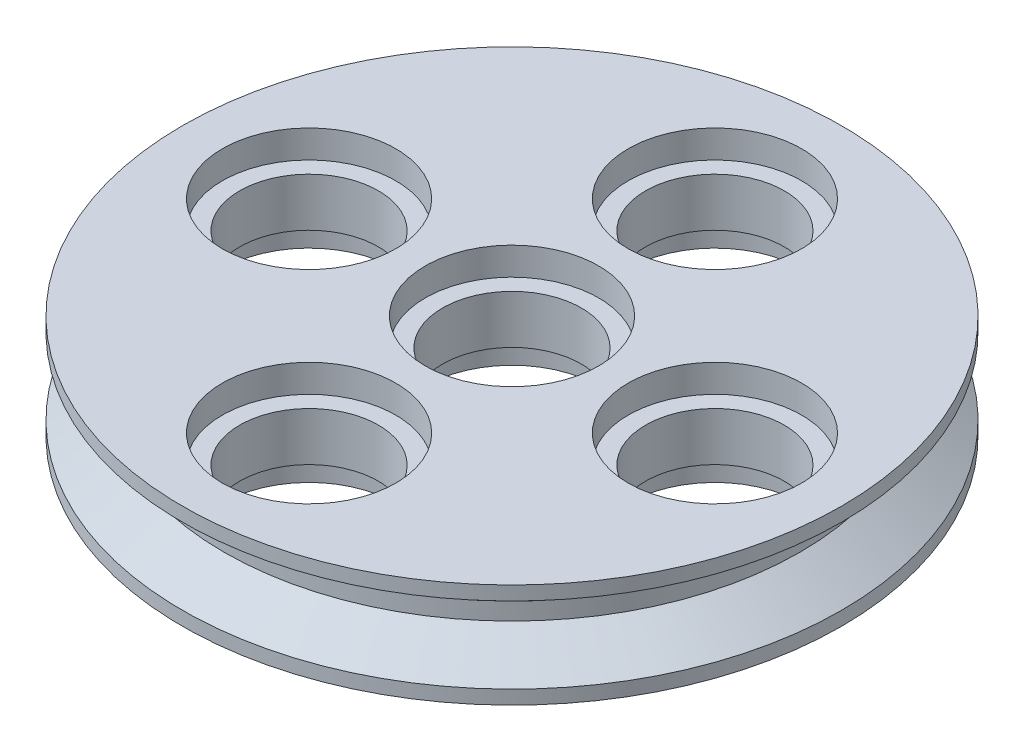
ISO-10303-21;
HEADER;
FILE_DESCRIPTION(('STEP AP214'),'2;1');
FILE_NAME('part.step','',(''),(''),'','','');
FILE_SCHEMA(('AUTOMOTIVE_DESIGN { 1 0 10303 214 1 1 1 1 }'));
ENDSEC;
DATA;
#1=APPLICATION_CONTEXT('core data for automotive mechanical design processes');
#2=APPLICATION_PROTOCOL_DEFINITION('international standard','automotive_design',2000,#1);
#3=PRODUCT_CONTEXT('',#1,'mechanical');
#4=PRODUCT('Part','Part','',(#3));
#5=PRODUCT_RELATED_PRODUCT_CATEGORY('part','',(#4));
#6=PRODUCT_DEFINITION_FORMATION('','',#4);
#7=PRODUCT_DEFINITION_CONTEXT('part definition',#1,'design');
#8=PRODUCT_DEFINITION('design','',#6,#7);
#9=PRODUCT_DEFINITION_SHAPE('','',#8);
#10=(LENGTH_UNIT() NAMED_UNIT(*) SI_UNIT(.MILLI.,.METRE.));
#11=(NAMED_UNIT(*) PLANE_ANGLE_UNIT() SI_UNIT($,.RADIAN.));
#12=(NAMED_UNIT(*) SI_UNIT($,.STERADIAN.) SOLID_ANGLE_UNIT());
#13=UNCERTAINTY_MEASURE_WITH_UNIT(LENGTH_MEASURE(1.E-05),#10,'distance_accuracy_value','');
#14=(GEOMETRIC_REPRESENTATION_CONTEXT(3) GLOBAL_UNCERTAINTY_ASSIGNED_CONTEXT((#13)) GLOBAL_UNIT_ASSIGNED_CONTEXT((#10,
#11,#12)) REPRESENTATION_CONTEXT('',''));
#15=CARTESIAN_POINT('',(0.,0.,0.));
#16=DIRECTION('',(0.,0.,1.));
#17=DIRECTION('',(1.,0.,0.));
#18=AXIS2_PLACEMENT_3D('',#15,#16,#17);
#19=CARTESIAN_POINT('',(0.,0.75,0.));
#20=DIRECTION('',(0.,1.,0.));
#21=DIRECTION('',(-1.,0.,0.));
#22=AXIS2_PLACEMENT_3D('',#19,#20,#21);
#23=CYLINDRICAL_SURFACE('',#22,8.3006668519548);
#24=CARTESIAN_POINT('',(0.,-0.500000000000001,0.));
#25=DIRECTION('',(0.,1.,0.));
#26=DIRECTION('',(-1.,0.,0.));
#27=AXIS2_PLACEMENT_3D('',#24,#25,#26);
#28=CIRCLE('',#27,8.3006668519548);
#29=CARTESIAN_POINT('',(-8.3006668519548,-0.500000000000003,0.));
#30=VERTEX_POINT('',#29);
#31=EDGE_CURVE('E10',#30,#30,#28,.T.);
#32=ORIENTED_EDGE('',*,*,#31,.F.);
#33=EDGE_LOOP('',(#32));
#34=FACE_BOUND('',#33,.T.);
#35=CARTESIAN_POINT('',(0.,-1.,0.));
#36=DIRECTION('',(0.,1.,0.));
#37=DIRECTION('',(-1.,0.,0.));
#38=AXIS2_PLACEMENT_3D('',#35,#36,#37);
#39=CIRCLE('',#38,8.3006668519548);
#40=CARTESIAN_POINT('',(-8.3006668519548,-1.,0.));
#41=VERTEX_POINT('',#40);
#42=EDGE_CURVE('E91',#41,#41,#39,.T.);
#43=ORIENTED_EDGE('',*,*,#42,.T.);
#44=EDGE_LOOP('',(#43));
#45=FACE_BOUND('',#44,.T.);
#46=ADVANCED_FACE('F30',(#34,#45),#23,.T.);
#47=CARTESIAN_POINT('',(0.,-0.500000000000001,0.));
#48=DIRECTION('',(0.,1.,0.));
#49=DIRECTION('',(-1.,0.,0.));
#50=AXIS2_PLACEMENT_3D('',#47,#48,#49);
#51=CONICAL_SURFACE('',#50,8.3006668519548,0.954237177155271);
#52=CARTESIAN_POINT('',(0.,0.349999999999997,0.));
#53=DIRECTION('',(0.,1.,0.));
#54=DIRECTION('',(-1.,0.,0.));
#55=AXIS2_PLACEMENT_3D('',#52,#53,#54);
#56=CIRCLE('',#55,9.5);
#57=CARTESIAN_POINT('',(-9.5,0.349999999999994,0.));
#58=VERTEX_POINT('',#57);
#59=EDGE_CURVE('E36',#58,#58,#56,.T.);
#60=ORIENTED_EDGE('',*,*,#59,.F.);
#61=EDGE_LOOP('',(#60));
#62=FACE_BOUND('',#61,.T.);
#63=ORIENTED_EDGE('',*,*,#31,.T.);
#64=EDGE_LOOP('',(#63));
#65=FACE_BOUND('',#64,.T.);
#66=ADVANCED_FACE('F161',(#62,#65),#51,.T.);
#67=CARTESIAN_POINT('',(0.,0.75,0.));
#68=DIRECTION('',(0.,1.,0.));
#69=DIRECTION('',(-1.,0.,0.));
#70=AXIS2_PLACEMENT_3D('',#67,#68,#69);
#71=CYLINDRICAL_SURFACE('',#70,9.5);
#72=CARTESIAN_POINT('',(0.,0.749999999999997,0.));
#73=DIRECTION('',(0.,1.,0.));
#74=DIRECTION('',(-1.,0.,0.));
#75=AXIS2_PLACEMENT_3D('',#72,#73,#74);
#76=CIRCLE('',#75,9.5);
#77=CARTESIAN_POINT('',(-9.5,0.749999999999994,0.));
#78=VERTEX_POINT('',#77);
#79=EDGE_CURVE('E40',#78,#78,#76,.T.);
#80=ORIENTED_EDGE('',*,*,#79,.F.);
#81=EDGE_LOOP('',(#80));
#82=FACE_BOUND('',#81,.T.);
#83=ORIENTED_EDGE('',*,*,#59,.T.);
#84=EDGE_LOOP('',(#83));
#85=FACE_BOUND('',#84,.T.);
#86=ADVANCED_FACE('F166',(#82,#85),#71,.T.);
#87=CARTESIAN_POINT('',(0.,0.749999999999998,0.));
#88=DIRECTION('',(0.,-1.,0.));
#89=DIRECTION('',(1.,0.,0.));
#90=AXIS2_PLACEMENT_3D('',#87,#88,#89);
#91=PLANE('',#90);
#92=CARTESIAN_POINT('',(0.,0.750000000000002,0.));
#93=DIRECTION('',(0.,1.,0.));
#94=DIRECTION('',(0.,0.,1.));
#95=AXIS2_PLACEMENT_3D('',#92,#93,#94);
#96=CIRCLE('',#95,2.5);
#97=CARTESIAN_POINT('',(0.,0.750000000000002,2.5));
#98=VERTEX_POINT('',#97);
#99=EDGE_CURVE('E88',#98,#98,#96,.T.);
#100=ORIENTED_EDGE('',*,*,#99,.F.);
#101=EDGE_LOOP('',(#100));
#102=FACE_BOUND('',#101,.T.);
#103=CARTESIAN_POINT('',(-5.85,0.75,0.));
#104=DIRECTION('',(0.,1.,0.));
#105=DIRECTION('',(0.,0.,1.));
#106=AXIS2_PLACEMENT_3D('',#103,#104,#105);
#107=CIRCLE('',#106,2.5);
#108=CARTESIAN_POINT('',(-5.85,0.75,2.5));
#109=VERTEX_POINT('',#108);
#110=EDGE_CURVE('E79',#109,#109,#107,.T.);
#111=ORIENTED_EDGE('',*,*,#110,.F.);
#112=EDGE_LOOP('',(#111));
#113=FACE_BOUND('',#112,.T.);
#114=CARTESIAN_POINT('',(5.85,0.750000000000004,0.));
#115=DIRECTION('',(0.,1.,0.));
#116=DIRECTION('',(0.,0.,1.));
#117=AXIS2_PLACEMENT_3D('',#114,#115,#116);
#118=CIRCLE('',#117,2.5);
#119=CARTESIAN_POINT('',(5.85,0.750000000000004,2.5));
#120=VERTEX_POINT('',#119);
#121=EDGE_CURVE('E70',#120,#120,#118,.T.);
#122=ORIENTED_EDGE('',*,*,#121,.F.);
#123=EDGE_LOOP('',(#122));
#124=FACE_BOUND('',#123,.T.);
#125=CARTESIAN_POINT('',(0.,0.750000000000002,-5.85));
#126=DIRECTION('',(0.,1.,0.));
#127=DIRECTION('',(0.,0.,1.));
#128=AXIS2_PLACEMENT_3D('',#125,#126,#127);
#129=CIRCLE('',#128,2.5);
#130=CARTESIAN_POINT('',(0.,0.750000000000002,-3.35));
#131=VERTEX_POINT('',#130);
#132=EDGE_CURVE('E61',#131,#131,#129,.T.);
#133=ORIENTED_EDGE('',*,*,#132,.F.);
#134=EDGE_LOOP('',(#133));
#135=FACE_BOUND('',#134,.T.);
#136=CARTESIAN_POINT('',(0.,0.750000000000002,5.85));
#137=DIRECTION('',(0.,1.,0.));
#138=DIRECTION('',(0.,0.,1.));
#139=AXIS2_PLACEMENT_3D('',#136,#137,#138);
#140=CIRCLE('',#139,2.5);
#141=CARTESIAN_POINT('',(0.,0.750000000000002,8.35));
#142=VERTEX_POINT('',#141);
#143=EDGE_CURVE('E52',#142,#142,#140,.T.);
#144=ORIENTED_EDGE('',*,*,#143,.F.);
#145=EDGE_LOOP('',(#144));
#146=FACE_BOUND('',#145,.T.);
#147=ORIENTED_EDGE('',*,*,#79,.T.);
#148=EDGE_LOOP('',(#147));
#149=FACE_BOUND('',#148,.T.);
#150=ADVANCED_FACE('F242',(#102,#113,#124,#135,#146,#149),#91,.F.);
#151=CARTESIAN_POINT('',(0.,0.749999999999998,5.85));
#152=DIRECTION('',(0.,1.,0.));
#153=DIRECTION('',(0.,0.,1.));
#154=AXIS2_PLACEMENT_3D('',#151,#152,#153);
#155=CYLINDRICAL_SURFACE('',#154,2.00000000000001);
#156=CARTESIAN_POINT('',(0.,-0.0499999999999968,5.85));
#157=DIRECTION('',(0.,1.,0.));
#158=DIRECTION('',(0.,0.,1.));
#159=AXIS2_PLACEMENT_3D('',#156,#157,#158);
#160=CIRCLE('',#159,2.00000000000001);
#161=CARTESIAN_POINT('',(0.,-0.0499999999999968,7.85000000000001));
#162=VERTEX_POINT('',#161);
#163=EDGE_CURVE('E44',#162,#162,#160,.T.);
#164=ORIENTED_EDGE('',*,*,#163,.T.);
#165=EDGE_LOOP('',(#164));
#166=FACE_BOUND('',#165,.T.);
#167=CARTESIAN_POINT('',(0.,-1.45000000000001,5.85));
#168=DIRECTION('',(0.,1.,0.));
#169=DIRECTION('',(0.,0.,1.));
#170=AXIS2_PLACEMENT_3D('',#167,#168,#169);
#171=CIRCLE('',#170,2.00000000000001);
#172=CARTESIAN_POINT('',(0.,-1.45000000000001,7.85000000000001));
#173=VERTEX_POINT('',#172);
#174=EDGE_CURVE('E100',#173,#173,#171,.T.);
#175=ORIENTED_EDGE('',*,*,#174,.F.);
#176=EDGE_LOOP('',(#175));
#177=FACE_BOUND('',#176,.T.);
#178=ADVANCED_FACE('F238',(#166,#177),#155,.F.);
#179=CARTESIAN_POINT('',(2.00000000000001,-0.0499999999999985,5.85));
#180=DIRECTION('',(0.,-1.,0.));
#181=DIRECTION('',(0.,0.,-1.));
#182=AXIS2_PLACEMENT_3D('',#179,#180,#181);
#183=PLANE('',#182);
#184=ORIENTED_EDGE('',*,*,#163,.F.);
#185=EDGE_LOOP('',(#184));
#186=FACE_BOUND('',#185,.T.);
#187=CARTESIAN_POINT('',(0.,-0.0500000000000002,5.85));
#188=DIRECTION('',(0.,1.,0.));
#189=DIRECTION('',(0.,0.,1.));
#190=AXIS2_PLACEMENT_3D('',#187,#188,#189);
#191=CIRCLE('',#190,2.5);
#192=CARTESIAN_POINT('',(0.,-0.0500000000000002,8.35));
#193=VERTEX_POINT('',#192);
#194=EDGE_CURVE('E49',#193,#193,#191,.T.);
#195=ORIENTED_EDGE('',*,*,#194,.T.);
#196=EDGE_LOOP('',(#195));
#197=FACE_BOUND('',#196,.T.);
#198=ADVANCED_FACE('F234',(#186,#197),#183,.F.);
#199=CARTESIAN_POINT('',(0.,0.749999999999998,5.85));
#200=DIRECTION('',(0.,1.,0.));
#201=DIRECTION('',(0.,0.,1.));
#202=AXIS2_PLACEMENT_3D('',#199,#200,#201);
#203=CYLINDRICAL_SURFACE('',#202,2.5);
#204=ORIENTED_EDGE('',*,*,#194,.F.);
#205=EDGE_LOOP('',(#204));
#206=FACE_BOUND('',#205,.T.);
#207=ORIENTED_EDGE('',*,*,#143,.T.);
#208=EDGE_LOOP('',(#207));
#209=FACE_BOUND('',#208,.T.);
#210=ADVANCED_FACE('F230',(#206,#209),#203,.F.);
#211=CARTESIAN_POINT('',(0.,0.749999999999998,-5.85));
#212=DIRECTION('',(0.,1.,0.));
#213=DIRECTION('',(0.,0.,1.));
#214=AXIS2_PLACEMENT_3D('',#211,#212,#213);
#215=CYLINDRICAL_SURFACE('',#214,2.00000000000001);
#216=CARTESIAN_POINT('',(0.,-0.0499999999999968,-5.85));
#217=DIRECTION('',(0.,1.,0.));
#218=DIRECTION('',(0.,0.,1.));
#219=AXIS2_PLACEMENT_3D('',#216,#217,#218);
#220=CIRCLE('',#219,2.00000000000001);
#221=CARTESIAN_POINT('',(0.,-0.0499999999999968,-3.84999999999999));
#222=VERTEX_POINT('',#221);
#223=EDGE_CURVE('E55',#222,#222,#220,.T.);
#224=ORIENTED_EDGE('',*,*,#223,.T.);
#225=EDGE_LOOP('',(#224));
#226=FACE_BOUND('',#225,.T.);
#227=CARTESIAN_POINT('',(0.,-1.45000000000001,-5.85));
#228=DIRECTION('',(0.,1.,0.));
#229=DIRECTION('',(0.,0.,1.));
#230=AXIS2_PLACEMENT_3D('',#227,#228,#229);
#231=CIRCLE('',#230,2.00000000000001);
#232=CARTESIAN_POINT('',(0.,-1.45000000000001,-3.84999999999999));
#233=VERTEX_POINT('',#232);
#234=EDGE_CURVE('E109',#233,#233,#231,.T.);
#235=ORIENTED_EDGE('',*,*,#234,.F.);
#236=EDGE_LOOP('',(#235));
#237=FACE_BOUND('',#236,.T.);
#238=ADVANCED_FACE('F226',(#226,#237),#215,.F.);
#239=CARTESIAN_POINT('',(2.00000000000001,-0.0499999999999985,-5.85));
#240=DIRECTION('',(0.,-1.,0.));
#241=DIRECTION('',(0.,0.,-1.));
#242=AXIS2_PLACEMENT_3D('',#239,#240,#241);
#243=PLANE('',#242);
#244=ORIENTED_EDGE('',*,*,#223,.F.);
#245=EDGE_LOOP('',(#244));
#246=FACE_BOUND('',#245,.T.);
#247=CARTESIAN_POINT('',(0.,-0.0500000000000002,-5.85));
#248=DIRECTION('',(0.,1.,0.));
#249=DIRECTION('',(0.,0.,1.));
#250=AXIS2_PLACEMENT_3D('',#247,#248,#249);
#251=CIRCLE('',#250,2.5);
#252=CARTESIAN_POINT('',(0.,-0.0500000000000002,-3.35));
#253=VERTEX_POINT('',#252);
#254=EDGE_CURVE('E58',#253,#253,#251,.T.);
#255=ORIENTED_EDGE('',*,*,#254,.T.);
#256=EDGE_LOOP('',(#255));
#257=FACE_BOUND('',#256,.T.);
#258=ADVANCED_FACE('F222',(#246,#257),#243,.F.);
#259=CARTESIAN_POINT('',(0.,0.749999999999998,-5.85));
#260=DIRECTION('',(0.,1.,0.));
#261=DIRECTION('',(0.,0.,1.));
#262=AXIS2_PLACEMENT_3D('',#259,#260,#261);
#263=CYLINDRICAL_SURFACE('',#262,2.5);
#264=ORIENTED_EDGE('',*,*,#254,.F.);
#265=EDGE_LOOP('',(#264));
#266=FACE_BOUND('',#265,.T.);
#267=ORIENTED_EDGE('',*,*,#132,.T.);
#268=EDGE_LOOP('',(#267));
#269=FACE_BOUND('',#268,.T.);
#270=ADVANCED_FACE('F218',(#266,#269),#263,.F.);
#271=CARTESIAN_POINT('',(5.85,0.75,0.));
#272=DIRECTION('',(0.,1.,0.));
#273=DIRECTION('',(0.,0.,1.));
#274=AXIS2_PLACEMENT_3D('',#271,#272,#273);
#275=CYLINDRICAL_SURFACE('',#274,2.00000000000001);
#276=CARTESIAN_POINT('',(5.85,-0.0499999999999949,0.));
#277=DIRECTION('',(0.,1.,0.));
#278=DIRECTION('',(0.,0.,1.));
#279=AXIS2_PLACEMENT_3D('',#276,#277,#278);
#280=CIRCLE('',#279,2.00000000000001);
#281=CARTESIAN_POINT('',(5.85,-0.0499999999999949,2.00000000000001));
#282=VERTEX_POINT('',#281);
#283=EDGE_CURVE('E64',#282,#282,#280,.T.);
#284=ORIENTED_EDGE('',*,*,#283,.T.);
#285=EDGE_LOOP('',(#284));
#286=FACE_BOUND('',#285,.T.);
#287=CARTESIAN_POINT('',(5.85,-1.45,0.));
#288=DIRECTION('',(0.,1.,0.));
#289=DIRECTION('',(0.,0.,1.));
#290=AXIS2_PLACEMENT_3D('',#287,#288,#289);
#291=CIRCLE('',#290,2.00000000000001);
#292=CARTESIAN_POINT('',(5.85,-1.45,2.00000000000001));
#293=VERTEX_POINT('',#292);
#294=EDGE_CURVE('E118',#293,#293,#291,.T.);
#295=ORIENTED_EDGE('',*,*,#294,.F.);
#296=EDGE_LOOP('',(#295));
#297=FACE_BOUND('',#296,.T.);
#298=ADVANCED_FACE('F214',(#286,#297),#275,.F.);
#299=CARTESIAN_POINT('',(7.85000000000001,-0.0499999999999967,0.));
#300=DIRECTION('',(0.,-1.,0.));
#301=DIRECTION('',(0.,0.,-1.));
#302=AXIS2_PLACEMENT_3D('',#299,#300,#301);
#303=PLANE('',#302);
#304=ORIENTED_EDGE('',*,*,#283,.F.);
#305=EDGE_LOOP('',(#304));
#306=FACE_BOUND('',#305,.T.);
#307=CARTESIAN_POINT('',(5.85,-0.0499999999999984,0.));
#308=DIRECTION('',(0.,1.,0.));
#309=DIRECTION('',(0.,0.,1.));
#310=AXIS2_PLACEMENT_3D('',#307,#308,#309);
#311=CIRCLE('',#310,2.5);
#312=CARTESIAN_POINT('',(5.85,-0.0499999999999984,2.5));
#313=VERTEX_POINT('',#312);
#314=EDGE_CURVE('E67',#313,#313,#311,.T.);
#315=ORIENTED_EDGE('',*,*,#314,.T.);
#316=EDGE_LOOP('',(#315));
#317=FACE_BOUND('',#316,.T.);
#318=ADVANCED_FACE('F210',(#306,#317),#303,.F.);
#319=CARTESIAN_POINT('',(5.85,0.75,0.));
#320=DIRECTION('',(0.,1.,0.));
#321=DIRECTION('',(0.,0.,1.));
#322=AXIS2_PLACEMENT_3D('',#319,#320,#321);
#323=CYLINDRICAL_SURFACE('',#322,2.5);
#324=ORIENTED_EDGE('',*,*,#314,.F.);
#325=EDGE_LOOP('',(#324));
#326=FACE_BOUND('',#325,.T.);
#327=ORIENTED_EDGE('',*,*,#121,.T.);
#328=EDGE_LOOP('',(#327));
#329=FACE_BOUND('',#328,.T.);
#330=ADVANCED_FACE('F206',(#326,#329),#323,.F.);
#331=CARTESIAN_POINT('',(-5.85,0.749999999999997,0.));
#332=DIRECTION('',(0.,1.,0.));
#333=DIRECTION('',(0.,0.,1.));
#334=AXIS2_PLACEMENT_3D('',#331,#332,#333);
#335=CYLINDRICAL_SURFACE('',#334,2.00000000000001);
#336=CARTESIAN_POINT('',(-5.85,-0.0499999999999986,0.));
#337=DIRECTION('',(0.,1.,0.));
#338=DIRECTION('',(0.,0.,1.));
#339=AXIS2_PLACEMENT_3D('',#336,#337,#338);
#340=CIRCLE('',#339,2.00000000000001);
#341=CARTESIAN_POINT('',(-5.85,-0.0499999999999986,2.00000000000001));
#342=VERTEX_POINT('',#341);
#343=EDGE_CURVE('E73',#342,#342,#340,.T.);
#344=ORIENTED_EDGE('',*,*,#343,.T.);
#345=EDGE_LOOP('',(#344));
#346=FACE_BOUND('',#345,.T.);
#347=CARTESIAN_POINT('',(-5.85,-1.45000000000001,0.));
#348=DIRECTION('',(0.,1.,0.));
#349=DIRECTION('',(0.,0.,1.));
#350=AXIS2_PLACEMENT_3D('',#347,#348,#349);
#351=CIRCLE('',#350,2.00000000000001);
#352=CARTESIAN_POINT('',(-5.85,-1.45000000000001,2.00000000000001));
#353=VERTEX_POINT('',#352);
#354=EDGE_CURVE('E127',#353,#353,#351,.T.);
#355=ORIENTED_EDGE('',*,*,#354,.F.);
#356=EDGE_LOOP('',(#355));
#357=FACE_BOUND('',#356,.T.);
#358=ADVANCED_FACE('F202',(#346,#357),#335,.F.);
#359=CARTESIAN_POINT('',(-3.84999999999999,-0.0500000000000003,0.));
#360=DIRECTION('',(0.,-1.,0.));
#361=DIRECTION('',(0.,0.,-1.));
#362=AXIS2_PLACEMENT_3D('',#359,#360,#361);
#363=PLANE('',#362);
#364=ORIENTED_EDGE('',*,*,#343,.F.);
#365=EDGE_LOOP('',(#364));
#366=FACE_BOUND('',#365,.T.);
#367=CARTESIAN_POINT('',(-5.85,-0.0500000000000021,0.));
#368=DIRECTION('',(0.,1.,0.));
#369=DIRECTION('',(0.,0.,1.));
#370=AXIS2_PLACEMENT_3D('',#367,#368,#369);
#371=CIRCLE('',#370,2.5);
#372=CARTESIAN_POINT('',(-5.85,-0.0500000000000021,2.5));
#373=VERTEX_POINT('',#372);
#374=EDGE_CURVE('E76',#373,#373,#371,.T.);
#375=ORIENTED_EDGE('',*,*,#374,.T.);
#376=EDGE_LOOP('',(#375));
#377=FACE_BOUND('',#376,.T.);
#378=ADVANCED_FACE('F198',(#366,#377),#363,.F.);
#379=CARTESIAN_POINT('',(-5.85,0.749999999999997,0.));
#380=DIRECTION('',(0.,1.,0.));
#381=DIRECTION('',(0.,0.,1.));
#382=AXIS2_PLACEMENT_3D('',#379,#380,#381);
#383=CYLINDRICAL_SURFACE('',#382,2.5);
#384=ORIENTED_EDGE('',*,*,#374,.F.);
#385=EDGE_LOOP('',(#384));
#386=FACE_BOUND('',#385,.T.);
#387=ORIENTED_EDGE('',*,*,#110,.T.);
#388=EDGE_LOOP('',(#387));
#389=FACE_BOUND('',#388,.T.);
#390=ADVANCED_FACE('F194',(#386,#389),#383,.F.);
#391=CARTESIAN_POINT('',(0.,0.749999999999998,0.));
#392=DIRECTION('',(0.,1.,0.));
#393=DIRECTION('',(0.,0.,1.));
#394=AXIS2_PLACEMENT_3D('',#391,#392,#393);
#395=CYLINDRICAL_SURFACE('',#394,2.00000000000001);
#396=CARTESIAN_POINT('',(0.,-0.0499999999999968,0.));
#397=DIRECTION('',(0.,1.,0.));
#398=DIRECTION('',(0.,0.,1.));
#399=AXIS2_PLACEMENT_3D('',#396,#397,#398);
#400=CIRCLE('',#399,2.00000000000001);
#401=CARTESIAN_POINT('',(0.,-0.0499999999999968,2.00000000000001));
#402=VERTEX_POINT('',#401);
#403=EDGE_CURVE('E82',#402,#402,#400,.T.);
#404=ORIENTED_EDGE('',*,*,#403,.T.);
#405=EDGE_LOOP('',(#404));
#406=FACE_BOUND('',#405,.T.);
#407=CARTESIAN_POINT('',(0.,-1.45000000000001,0.));
#408=DIRECTION('',(0.,1.,0.));
#409=DIRECTION('',(0.,0.,1.));
#410=AXIS2_PLACEMENT_3D('',#407,#408,#409);
#411=CIRCLE('',#410,2.00000000000001);
#412=CARTESIAN_POINT('',(0.,-1.45000000000001,2.00000000000001));
#413=VERTEX_POINT('',#412);
#414=EDGE_CURVE('E136',#413,#413,#411,.T.);
#415=ORIENTED_EDGE('',*,*,#414,.F.);
#416=EDGE_LOOP('',(#415));
#417=FACE_BOUND('',#416,.T.);
#418=ADVANCED_FACE('F190',(#406,#417),#395,.F.);
#419=CARTESIAN_POINT('',(2.00000000000001,-0.0499999999999985,0.));
#420=DIRECTION('',(0.,-1.,0.));
#421=DIRECTION('',(0.,0.,-1.));
#422=AXIS2_PLACEMENT_3D('',#419,#420,#421);
#423=PLANE('',#422);
#424=ORIENTED_EDGE('',*,*,#403,.F.);
#425=EDGE_LOOP('',(#424));
#426=FACE_BOUND('',#425,.T.);
#427=CARTESIAN_POINT('',(0.,-0.0500000000000002,0.));
#428=DIRECTION('',(0.,1.,0.));
#429=DIRECTION('',(0.,0.,1.));
#430=AXIS2_PLACEMENT_3D('',#427,#428,#429);
#431=CIRCLE('',#430,2.5);
#432=CARTESIAN_POINT('',(0.,-0.0500000000000002,2.5));
#433=VERTEX_POINT('',#432);
#434=EDGE_CURVE('E85',#433,#433,#431,.T.);
#435=ORIENTED_EDGE('',*,*,#434,.T.);
#436=EDGE_LOOP('',(#435));
#437=FACE_BOUND('',#436,.T.);
#438=ADVANCED_FACE('F183',(#426,#437),#423,.F.);
#439=CARTESIAN_POINT('',(0.,0.749999999999998,0.));
#440=DIRECTION('',(0.,1.,0.));
#441=DIRECTION('',(0.,0.,1.));
#442=AXIS2_PLACEMENT_3D('',#439,#440,#441);
#443=CYLINDRICAL_SURFACE('',#442,2.5);
#444=ORIENTED_EDGE('',*,*,#434,.F.);
#445=EDGE_LOOP('',(#444));
#446=FACE_BOUND('',#445,.T.);
#447=ORIENTED_EDGE('',*,*,#99,.T.);
#448=EDGE_LOOP('',(#447));
#449=FACE_BOUND('',#448,.T.);
#450=ADVANCED_FACE('F174',(#446,#449),#443,.F.);
#451=CARTESIAN_POINT('',(0.,-1.,0.));
#452=DIRECTION('',(0.,-1.,0.));
#453=DIRECTION('',(-1.,0.,0.));
#454=AXIS2_PLACEMENT_3D('',#451,#452,#453);
#455=CONICAL_SURFACE('',#454,8.3006668519548,0.954237177155271);
#456=CARTESIAN_POINT('',(0.,-1.85,0.));
#457=DIRECTION('',(0.,1.,0.));
#458=DIRECTION('',(-1.,0.,0.));
#459=AXIS2_PLACEMENT_3D('',#456,#457,#458);
#460=CIRCLE('',#459,9.5);
#461=CARTESIAN_POINT('',(-9.5,-1.85,0.));
#462=VERTEX_POINT('',#461);
#463=EDGE_CURVE('E94',#462,#462,#460,.T.);
#464=ORIENTED_EDGE('',*,*,#463,.T.);
#465=EDGE_LOOP('',(#464));
#466=FACE_BOUND('',#465,.T.);
#467=ORIENTED_EDGE('',*,*,#42,.F.);
#468=EDGE_LOOP('',(#467));
#469=FACE_BOUND('',#468,.T.);
#470=ADVANCED_FACE('F171',(#466,#469),#455,.T.);
#471=CARTESIAN_POINT('',(0.,-2.25,0.));
#472=DIRECTION('',(0.,-1.,0.));
#473=DIRECTION('',(-1.,0.,0.));
#474=AXIS2_PLACEMENT_3D('',#471,#472,#473);
#475=CYLINDRICAL_SURFACE('',#474,9.5);
#476=CARTESIAN_POINT('',(0.,-2.25,0.));
#477=DIRECTION('',(0.,1.,0.));
#478=DIRECTION('',(-1.,0.,0.));
#479=AXIS2_PLACEMENT_3D('',#476,#477,#478);
#480=CIRCLE('',#479,9.5);
#481=CARTESIAN_POINT('',(-9.5,-2.25,0.));
#482=VERTEX_POINT('',#481);
#483=EDGE_CURVE('E97',#482,#482,#480,.T.);
#484=ORIENTED_EDGE('',*,*,#483,.T.);
#485=EDGE_LOOP('',(#484));
#486=FACE_BOUND('',#485,.T.);
#487=ORIENTED_EDGE('',*,*,#463,.F.);
#488=EDGE_LOOP('',(#487));
#489=FACE_BOUND('',#488,.T.);
#490=ADVANCED_FACE('F173',(#486,#489),#475,.T.);
#491=CARTESIAN_POINT('',(0.,-2.25,0.));
#492=DIRECTION('',(0.,1.,0.));
#493=DIRECTION('',(1.,0.,0.));
#494=AXIS2_PLACEMENT_3D('',#491,#492,#493);
#495=PLANE('',#494);
#496=CARTESIAN_POINT('',(0.,-2.25,0.));
#497=DIRECTION('',(0.,1.,0.));
#498=DIRECTION('',(0.,0.,1.));
#499=AXIS2_PLACEMENT_3D('',#496,#497,#498);
#500=CIRCLE('',#499,2.5);
#501=CARTESIAN_POINT('',(0.,-2.25,2.5));
#502=VERTEX_POINT('',#501);
#503=EDGE_CURVE('E142',#502,#502,#500,.T.);
#504=ORIENTED_EDGE('',*,*,#503,.T.);
#505=EDGE_LOOP('',(#504));
#506=FACE_BOUND('',#505,.T.);
#507=CARTESIAN_POINT('',(-5.85,-2.25000000000001,0.));
#508=DIRECTION('',(0.,1.,0.));
#509=DIRECTION('',(0.,0.,1.));
#510=AXIS2_PLACEMENT_3D('',#507,#508,#509);
#511=CIRCLE('',#510,2.5);
#512=CARTESIAN_POINT('',(-5.85,-2.25000000000001,2.5));
#513=VERTEX_POINT('',#512);
#514=EDGE_CURVE('E133',#513,#513,#511,.T.);
#515=ORIENTED_EDGE('',*,*,#514,.T.);
#516=EDGE_LOOP('',(#515));
#517=FACE_BOUND('',#516,.T.);
#518=CARTESIAN_POINT('',(5.85,-2.25,0.));
#519=DIRECTION('',(0.,1.,0.));
#520=DIRECTION('',(0.,0.,1.));
#521=AXIS2_PLACEMENT_3D('',#518,#519,#520);
#522=CIRCLE('',#521,2.5);
#523=CARTESIAN_POINT('',(5.85,-2.25,2.5));
#524=VERTEX_POINT('',#523);
#525=EDGE_CURVE('E124',#524,#524,#522,.T.);
#526=ORIENTED_EDGE('',*,*,#525,.T.);
#527=EDGE_LOOP('',(#526));
#528=FACE_BOUND('',#527,.T.);
#529=CARTESIAN_POINT('',(0.,-2.25,-5.85));
#530=DIRECTION('',(0.,1.,0.));
#531=DIRECTION('',(0.,0.,1.));
#532=AXIS2_PLACEMENT_3D('',#529,#530,#531);
#533=CIRCLE('',#532,2.5);
#534=CARTESIAN_POINT('',(0.,-2.25,-3.35));
#535=VERTEX_POINT('',#534);
#536=EDGE_CURVE('E115',#535,#535,#533,.T.);
#537=ORIENTED_EDGE('',*,*,#536,.T.);
#538=EDGE_LOOP('',(#537));
#539=FACE_BOUND('',#538,.T.);
#540=CARTESIAN_POINT('',(0.,-2.25,5.85));
#541=DIRECTION('',(0.,1.,0.));
#542=DIRECTION('',(0.,0.,1.));
#543=AXIS2_PLACEMENT_3D('',#540,#541,#542);
#544=CIRCLE('',#543,2.5);
#545=CARTESIAN_POINT('',(0.,-2.25,8.35));
#546=VERTEX_POINT('',#545);
#547=EDGE_CURVE('E106',#546,#546,#544,.T.);
#548=ORIENTED_EDGE('',*,*,#547,.T.);
#549=EDGE_LOOP('',(#548));
#550=FACE_BOUND('',#549,.T.);
#551=ORIENTED_EDGE('',*,*,#483,.F.);
#552=EDGE_LOOP('',(#551));
#553=FACE_BOUND('',#552,.T.);
#554=ADVANCED_FACE('F146',(#506,#517,#528,#539,#550,#553),#495,.F.);
#555=CARTESIAN_POINT('',(2.00000000000001,-1.45,5.85));
#556=DIRECTION('',(0.,1.,0.));
#557=DIRECTION('',(0.,0.,-1.));
#558=AXIS2_PLACEMENT_3D('',#555,#556,#557);
#559=PLANE('',#558);
#560=ORIENTED_EDGE('',*,*,#174,.T.);
#561=EDGE_LOOP('',(#560));
#562=FACE_BOUND('',#561,.T.);
#563=CARTESIAN_POINT('',(0.,-1.45,5.85));
#564=DIRECTION('',(0.,1.,0.));
#565=DIRECTION('',(0.,0.,1.));
#566=AXIS2_PLACEMENT_3D('',#563,#564,#565);
#567=CIRCLE('',#566,2.5);
#568=CARTESIAN_POINT('',(0.,-1.45,8.35));
#569=VERTEX_POINT('',#568);
#570=EDGE_CURVE('E103',#569,#569,#567,.T.);
#571=ORIENTED_EDGE('',*,*,#570,.F.);
#572=EDGE_LOOP('',(#571));
#573=FACE_BOUND('',#572,.T.);
#574=ADVANCED_FACE('F381',(#562,#573),#559,.F.);
#575=CARTESIAN_POINT('',(0.,-2.25,5.85));
#576=DIRECTION('',(0.,-1.,0.));
#577=DIRECTION('',(0.,0.,1.));
#578=AXIS2_PLACEMENT_3D('',#575,#576,#577);
#579=CYLINDRICAL_SURFACE('',#578,2.5);
#580=ORIENTED_EDGE('',*,*,#570,.T.);
#581=EDGE_LOOP('',(#580));
#582=FACE_BOUND('',#581,.T.);
#583=ORIENTED_EDGE('',*,*,#547,.F.);
#584=EDGE_LOOP('',(#583));
#585=FACE_BOUND('',#584,.T.);
#586=ADVANCED_FACE('F388',(#582,#585),#579,.F.);
#587=CARTESIAN_POINT('',(2.00000000000001,-1.45,-5.85));
#588=DIRECTION('',(0.,1.,0.));
#589=DIRECTION('',(0.,0.,-1.));
#590=AXIS2_PLACEMENT_3D('',#587,#588,#589);
#591=PLANE('',#590);
#592=ORIENTED_EDGE('',*,*,#234,.T.);
#593=EDGE_LOOP('',(#592));
#594=FACE_BOUND('',#593,.T.);
#595=CARTESIAN_POINT('',(0.,-1.45,-5.85));
#596=DIRECTION('',(0.,1.,0.));
#597=DIRECTION('',(0.,0.,1.));
#598=AXIS2_PLACEMENT_3D('',#595,#596,#597);
#599=CIRCLE('',#598,2.5);
#600=CARTESIAN_POINT('',(0.,-1.45,-3.35));
#601=VERTEX_POINT('',#600);
#602=EDGE_CURVE('E112',#601,#601,#599,.T.);
#603=ORIENTED_EDGE('',*,*,#602,.F.);
#604=EDGE_LOOP('',(#603));
#605=FACE_BOUND('',#604,.T.);
#606=ADVANCED_FACE('F397',(#594,#605),#591,.F.);
#607=CARTESIAN_POINT('',(0.,-2.25,-5.85));
#608=DIRECTION('',(0.,-1.,0.));
#609=DIRECTION('',(0.,0.,1.));
#610=AXIS2_PLACEMENT_3D('',#607,#608,#609);
#611=CYLINDRICAL_SURFACE('',#610,2.5);
#612=ORIENTED_EDGE('',*,*,#602,.T.);
#613=EDGE_LOOP('',(#612));
#614=FACE_BOUND('',#613,.T.);
#615=ORIENTED_EDGE('',*,*,#536,.F.);
#616=EDGE_LOOP('',(#615));
#617=FACE_BOUND('',#616,.T.);
#618=ADVANCED_FACE('F406',(#614,#617),#611,.F.);
#619=CARTESIAN_POINT('',(7.85000000000001,-1.45,0.));
#620=DIRECTION('',(0.,1.,0.));
#621=DIRECTION('',(0.,0.,-1.));
#622=AXIS2_PLACEMENT_3D('',#619,#620,#621);
#623=PLANE('',#622);
#624=ORIENTED_EDGE('',*,*,#294,.T.);
#625=EDGE_LOOP('',(#624));
#626=FACE_BOUND('',#625,.T.);
#627=CARTESIAN_POINT('',(5.85,-1.45,0.));
#628=DIRECTION('',(0.,1.,0.));
#629=DIRECTION('',(0.,0.,1.));
#630=AXIS2_PLACEMENT_3D('',#627,#628,#629);
#631=CIRCLE('',#630,2.5);
#632=CARTESIAN_POINT('',(5.85,-1.45,2.5));
#633=VERTEX_POINT('',#632);
#634=EDGE_CURVE('E121',#633,#633,#631,.T.);
#635=ORIENTED_EDGE('',*,*,#634,.F.);
#636=EDGE_LOOP('',(#635));
#637=FACE_BOUND('',#636,.T.);
#638=ADVANCED_FACE('F415',(#626,#637),#623,.F.);
#639=CARTESIAN_POINT('',(5.85,-2.25,0.));
#640=DIRECTION('',(0.,-1.,0.));
#641=DIRECTION('',(0.,0.,1.));
#642=AXIS2_PLACEMENT_3D('',#639,#640,#641);
#643=CYLINDRICAL_SURFACE('',#642,2.5);
#644=ORIENTED_EDGE('',*,*,#634,.T.);
#645=EDGE_LOOP('',(#644));
#646=FACE_BOUND('',#645,.T.);
#647=ORIENTED_EDGE('',*,*,#525,.F.);
#648=EDGE_LOOP('',(#647));
#649=FACE_BOUND('',#648,.T.);
#650=ADVANCED_FACE('F424',(#646,#649),#643,.F.);
#651=CARTESIAN_POINT('',(-3.84999999999999,-1.45,0.));
#652=DIRECTION('',(0.,1.,0.));
#653=DIRECTION('',(0.,0.,-1.));
#654=AXIS2_PLACEMENT_3D('',#651,#652,#653);
#655=PLANE('',#654);
#656=ORIENTED_EDGE('',*,*,#354,.T.);
#657=EDGE_LOOP('',(#656));
#658=FACE_BOUND('',#657,.T.);
#659=CARTESIAN_POINT('',(-5.85,-1.45,0.));
#660=DIRECTION('',(0.,1.,0.));
#661=DIRECTION('',(0.,0.,1.));
#662=AXIS2_PLACEMENT_3D('',#659,#660,#661);
#663=CIRCLE('',#662,2.5);
#664=CARTESIAN_POINT('',(-5.85,-1.45,2.5));
#665=VERTEX_POINT('',#664);
#666=EDGE_CURVE('E130',#665,#665,#663,.T.);
#667=ORIENTED_EDGE('',*,*,#666,.F.);
#668=EDGE_LOOP('',(#667));
#669=FACE_BOUND('',#668,.T.);
#670=ADVANCED_FACE('F433',(#658,#669),#655,.F.);
#671=CARTESIAN_POINT('',(-5.85,-2.25,0.));
#672=DIRECTION('',(0.,-1.,0.));
#673=DIRECTION('',(0.,0.,1.));
#674=AXIS2_PLACEMENT_3D('',#671,#672,#673);
#675=CYLINDRICAL_SURFACE('',#674,2.5);
#676=ORIENTED_EDGE('',*,*,#666,.T.);
#677=EDGE_LOOP('',(#676));
#678=FACE_BOUND('',#677,.T.);
#679=ORIENTED_EDGE('',*,*,#514,.F.);
#680=EDGE_LOOP('',(#679));
#681=FACE_BOUND('',#680,.T.);
#682=ADVANCED_FACE('F157',(#678,#681),#675,.F.);
#683=CARTESIAN_POINT('',(2.00000000000001,-1.45,0.));
#684=DIRECTION('',(0.,1.,0.));
#685=DIRECTION('',(0.,0.,-1.));
#686=AXIS2_PLACEMENT_3D('',#683,#684,#685);
#687=PLANE('',#686);
#688=ORIENTED_EDGE('',*,*,#414,.T.);
#689=EDGE_LOOP('',(#688));
#690=FACE_BOUND('',#689,.T.);
#691=CARTESIAN_POINT('',(0.,-1.45,0.));
#692=DIRECTION('',(0.,1.,0.));
#693=DIRECTION('',(0.,0.,1.));
#694=AXIS2_PLACEMENT_3D('',#691,#692,#693);
#695=CIRCLE('',#694,2.5);
#696=CARTESIAN_POINT('',(0.,-1.45,2.5));
#697=VERTEX_POINT('',#696);
#698=EDGE_CURVE('E139',#697,#697,#695,.T.);
#699=ORIENTED_EDGE('',*,*,#698,.F.);
#700=EDGE_LOOP('',(#699));
#701=FACE_BOUND('',#700,.T.);
#702=ADVANCED_FACE('F151',(#690,#701),#687,.F.);
#703=CARTESIAN_POINT('',(0.,-2.25,0.));
#704=DIRECTION('',(0.,-1.,0.));
#705=DIRECTION('',(0.,0.,1.));
#706=AXIS2_PLACEMENT_3D('',#703,#704,#705);
#707=CYLINDRICAL_SURFACE('',#706,2.5);
#708=ORIENTED_EDGE('',*,*,#698,.T.);
#709=EDGE_LOOP('',(#708));
#710=FACE_BOUND('',#709,.T.);
#711=ORIENTED_EDGE('',*,*,#503,.F.);
#712=EDGE_LOOP('',(#711));
#713=FACE_BOUND('',#712,.T.);
#714=ADVANCED_FACE('F149',(#710,#713),#707,.F.);
#715=CLOSED_SHELL('',(#46,#66,#86,#150,#178,#198,#210,#238,#258,#270,#298,#318,#330,#358,#378,
#390,#418,#438,#450,#470,#490,#554,#574,#586,#606,#618,#638,#650,#670,#682,#702,#714));
#716=MANIFOLD_SOLID_BREP('B2',#715);
#717=ADVANCED_BREP_SHAPE_REPRESENTATION('',(#18,#716),#14);
#718=SHAPE_DEFINITION_REPRESENTATION(#9,#717);
ENDSEC;
END-ISO-10303-21;
